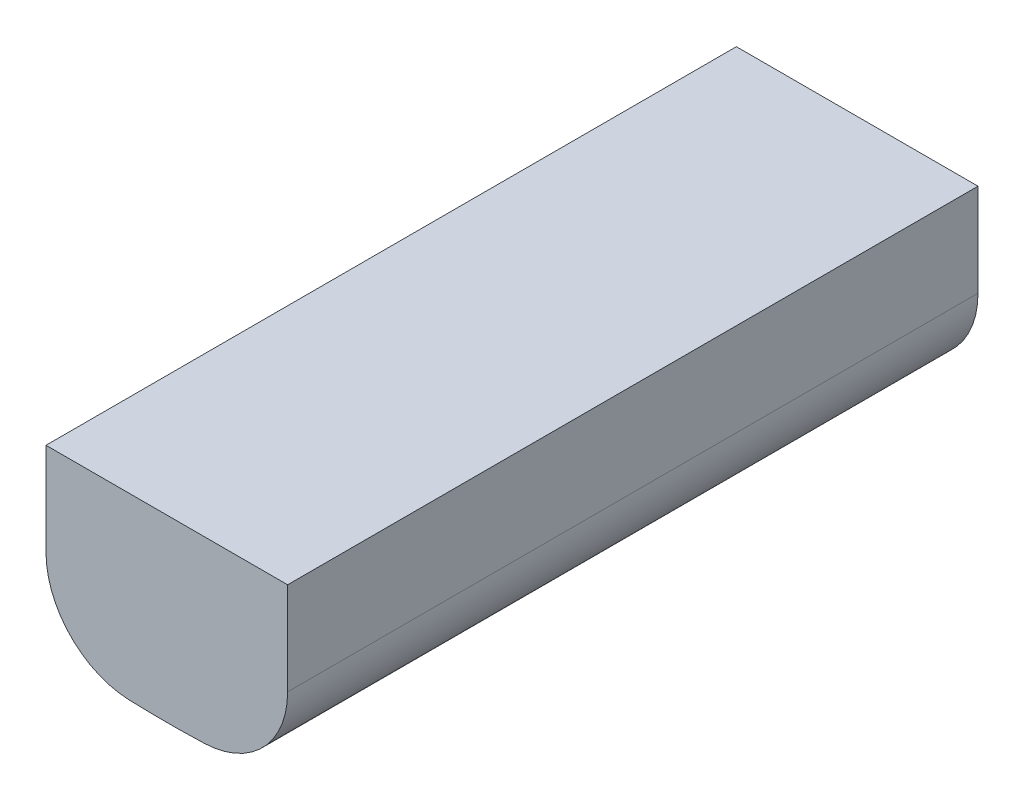
ISO-10303-21;
HEADER;
FILE_DESCRIPTION(('STEP AP214'),'2;1');
FILE_NAME('part.step','',(''),(''),'','','');
FILE_SCHEMA(('AUTOMOTIVE_DESIGN { 1 0 10303 214 1 1 1 1 }'));
ENDSEC;
DATA;
#1=APPLICATION_CONTEXT('core data for automotive mechanical design processes');
#2=APPLICATION_PROTOCOL_DEFINITION('international standard','automotive_design',2000,#1);
#3=PRODUCT_CONTEXT('',#1,'mechanical');
#4=PRODUCT('Part','Part','',(#3));
#5=PRODUCT_RELATED_PRODUCT_CATEGORY('part','',(#4));
#6=PRODUCT_DEFINITION_FORMATION('','',#4);
#7=PRODUCT_DEFINITION_CONTEXT('part definition',#1,'design');
#8=PRODUCT_DEFINITION('design','',#6,#7);
#9=PRODUCT_DEFINITION_SHAPE('','',#8);
#10=(LENGTH_UNIT() NAMED_UNIT(*) SI_UNIT(.MILLI.,.METRE.));
#11=(NAMED_UNIT(*) PLANE_ANGLE_UNIT() SI_UNIT($,.RADIAN.));
#12=(NAMED_UNIT(*) SI_UNIT($,.STERADIAN.) SOLID_ANGLE_UNIT());
#13=UNCERTAINTY_MEASURE_WITH_UNIT(LENGTH_MEASURE(1.E-05),#10,'distance_accuracy_value','');
#14=(GEOMETRIC_REPRESENTATION_CONTEXT(3) GLOBAL_UNCERTAINTY_ASSIGNED_CONTEXT((#13)) GLOBAL_UNIT_ASSIGNED_CONTEXT((#10,
#11,#12)) REPRESENTATION_CONTEXT('',''));
#15=CARTESIAN_POINT('',(0.,0.,0.));
#16=DIRECTION('',(0.,0.,1.));
#17=DIRECTION('',(1.,0.,0.));
#18=AXIS2_PLACEMENT_3D('',#15,#16,#17);
#19=CARTESIAN_POINT('',(0.05,-1.37409060836613,1.));
#20=DIRECTION('',(0.,0.,-1.));
#21=DIRECTION('',(-1.,0.,0.));
#22=AXIS2_PLACEMENT_3D('',#19,#20,#21);
#23=CYLINDRICAL_SURFACE('',#22,0.125);
#24=CARTESIAN_POINT('',(0.05,-1.37409060836613,0.));
#25=DIRECTION('',(0.,0.,1.));
#26=DIRECTION('',(-1.,0.,0.));
#27=AXIS2_PLACEMENT_3D('',#24,#25,#26);
#28=CIRCLE('',#27,0.125);
#29=CARTESIAN_POINT('',(0.0545454545454544,-1.49900793639941,0.));
#30=VERTEX_POINT('',#29);
#31=CARTESIAN_POINT('',(0.175,-1.37409060836613,0.));
#32=VERTEX_POINT('',#31);
#33=EDGE_CURVE('E116',#30,#32,#28,.T.);
#34=ORIENTED_EDGE('',*,*,#33,.T.);
#35=DIRECTION('',(0.,0.,-1.));
#36=VECTOR('',#35,1.);
#37=CARTESIAN_POINT('',(0.175,-1.37409060836613,1.));
#38=LINE('',#37,#36);
#39=CARTESIAN_POINT('',(0.175,-1.37409060836613,1.));
#40=VERTEX_POINT('',#39);
#41=EDGE_CURVE('E11',#40,#32,#38,.T.);
#42=ORIENTED_EDGE('',*,*,#41,.F.);
#43=CARTESIAN_POINT('',(0.05,-1.37409060836613,1.));
#44=DIRECTION('',(0.,0.,1.));
#45=DIRECTION('',(-1.,0.,0.));
#46=AXIS2_PLACEMENT_3D('',#43,#44,#45);
#47=CIRCLE('',#46,0.125);
#48=CARTESIAN_POINT('',(0.0545454545454544,-1.49900793639941,1.));
#49=VERTEX_POINT('',#48);
#50=EDGE_CURVE('E126',#49,#40,#47,.T.);
#51=ORIENTED_EDGE('',*,*,#50,.F.);
#52=DIRECTION('',(0.,0.,-1.));
#53=VECTOR('',#52,1.);
#54=CARTESIAN_POINT('',(0.0545454545454544,-1.49900793639941,1.));
#55=LINE('',#54,#53);
#56=EDGE_CURVE('E112',#49,#30,#55,.T.);
#57=ORIENTED_EDGE('',*,*,#56,.T.);
#58=EDGE_LOOP('',(#34,#42,#51,#57));
#59=FACE_BOUND('',#58,.T.);
#60=ADVANCED_FACE('F32',(#59),#23,.T.);
#61=CARTESIAN_POINT('',(0.175,-1.23975669154396,1.));
#62=DIRECTION('',(-1.,0.,0.));
#63=DIRECTION('',(0.,-1.,0.));
#64=AXIS2_PLACEMENT_3D('',#61,#62,#63);
#65=PLANE('',#64);
#66=DIRECTION('',(0.,1.,0.));
#67=VECTOR('',#66,1.);
#68=CARTESIAN_POINT('',(0.175,-1.23975669154396,0.));
#69=LINE('',#68,#67);
#70=CARTESIAN_POINT('',(0.175,-1.23975669154396,0.));
#71=VERTEX_POINT('',#70);
#72=EDGE_CURVE('E119',#32,#71,#69,.T.);
#73=ORIENTED_EDGE('',*,*,#72,.T.);
#74=DIRECTION('',(0.,0.,-1.));
#75=VECTOR('',#74,1.);
#76=CARTESIAN_POINT('',(0.175,-1.23975669154396,1.));
#77=LINE('',#76,#75);
#78=CARTESIAN_POINT('',(0.175,-1.23975669154396,1.));
#79=VERTEX_POINT('',#78);
#80=EDGE_CURVE('E40',#79,#71,#77,.T.);
#81=ORIENTED_EDGE('',*,*,#80,.F.);
#82=DIRECTION('',(0.,1.,0.));
#83=VECTOR('',#82,1.);
#84=CARTESIAN_POINT('',(0.175,-1.23975669154396,1.));
#85=LINE('',#84,#83);
#86=EDGE_CURVE('E85',#40,#79,#85,.T.);
#87=ORIENTED_EDGE('',*,*,#86,.F.);
#88=ORIENTED_EDGE('',*,*,#41,.T.);
#89=EDGE_LOOP('',(#73,#81,#87,#88));
#90=FACE_BOUND('',#89,.T.);
#91=ADVANCED_FACE('F150',(#90),#65,.F.);
#92=CARTESIAN_POINT('',(-0.175,-1.23975669154396,1.));
#93=DIRECTION('',(0.,-1.,0.));
#94=DIRECTION('',(1.,0.,0.));
#95=AXIS2_PLACEMENT_3D('',#92,#93,#94);
#96=PLANE('',#95);
#97=DIRECTION('',(-1.,0.,0.));
#98=VECTOR('',#97,1.);
#99=CARTESIAN_POINT('',(-0.175,-1.23975669154396,0.));
#100=LINE('',#99,#98);
#101=CARTESIAN_POINT('',(-0.175,-1.23975669154396,0.));
#102=VERTEX_POINT('',#101);
#103=EDGE_CURVE('E121',#71,#102,#100,.T.);
#104=ORIENTED_EDGE('',*,*,#103,.T.);
#105=DIRECTION('',(0.,0.,-1.));
#106=VECTOR('',#105,1.);
#107=CARTESIAN_POINT('',(-0.175,-1.23975669154396,1.));
#108=LINE('',#107,#106);
#109=CARTESIAN_POINT('',(-0.175,-1.23975669154396,1.));
#110=VERTEX_POINT('',#109);
#111=EDGE_CURVE('E107',#110,#102,#108,.T.);
#112=ORIENTED_EDGE('',*,*,#111,.F.);
#113=DIRECTION('',(-1.,0.,0.));
#114=VECTOR('',#113,1.);
#115=CARTESIAN_POINT('',(-0.175,-1.23975669154396,1.));
#116=LINE('',#115,#114);
#117=EDGE_CURVE('E98',#79,#110,#116,.T.);
#118=ORIENTED_EDGE('',*,*,#117,.F.);
#119=ORIENTED_EDGE('',*,*,#80,.T.);
#120=EDGE_LOOP('',(#104,#112,#118,#119));
#121=FACE_BOUND('',#120,.T.);
#122=ADVANCED_FACE('F132',(#121),#96,.F.);
#123=CARTESIAN_POINT('',(-0.175,-1.23975669154396,1.));
#124=DIRECTION('',(1.,0.,0.));
#125=DIRECTION('',(0.,1.,0.));
#126=AXIS2_PLACEMENT_3D('',#123,#124,#125);
#127=PLANE('',#126);
#128=DIRECTION('',(0.,-1.,0.));
#129=VECTOR('',#128,1.);
#130=CARTESIAN_POINT('',(-0.175,-1.23975669154396,0.));
#131=LINE('',#130,#129);
#132=CARTESIAN_POINT('',(-0.175,-1.37409060836613,0.));
#133=VERTEX_POINT('',#132);
#134=EDGE_CURVE('E106',#102,#133,#131,.T.);
#135=ORIENTED_EDGE('',*,*,#134,.T.);
#136=DIRECTION('',(0.,0.,-1.));
#137=VECTOR('',#136,1.);
#138=CARTESIAN_POINT('',(-0.175,-1.37409060836613,1.));
#139=LINE('',#138,#137);
#140=CARTESIAN_POINT('',(-0.175,-1.37409060836613,1.));
#141=VERTEX_POINT('',#140);
#142=EDGE_CURVE('E103',#141,#133,#139,.T.);
#143=ORIENTED_EDGE('',*,*,#142,.F.);
#144=DIRECTION('',(0.,-1.,0.));
#145=VECTOR('',#144,1.);
#146=CARTESIAN_POINT('',(-0.175,-1.23975669154396,1.));
#147=LINE('',#146,#145);
#148=EDGE_CURVE('E92',#110,#141,#147,.T.);
#149=ORIENTED_EDGE('',*,*,#148,.F.);
#150=ORIENTED_EDGE('',*,*,#111,.T.);
#151=EDGE_LOOP('',(#135,#143,#149,#150));
#152=FACE_BOUND('',#151,.T.);
#153=ADVANCED_FACE('F104',(#152),#127,.F.);
#154=CARTESIAN_POINT('',(-0.05,-1.37409060836613,1.));
#155=DIRECTION('',(0.,0.,-1.));
#156=DIRECTION('',(-1.,0.,0.));
#157=AXIS2_PLACEMENT_3D('',#154,#155,#156);
#158=CYLINDRICAL_SURFACE('',#157,0.125);
#159=CARTESIAN_POINT('',(-0.05,-1.37409060836613,0.));
#160=DIRECTION('',(0.,0.,1.));
#161=DIRECTION('',(1.,0.,0.));
#162=AXIS2_PLACEMENT_3D('',#159,#160,#161);
#163=CIRCLE('',#162,0.125);
#164=CARTESIAN_POINT('',(-0.0545454545454546,-1.49900793639941,0.));
#165=VERTEX_POINT('',#164);
#166=EDGE_CURVE('E71',#133,#165,#163,.T.);
#167=ORIENTED_EDGE('',*,*,#166,.T.);
#168=DIRECTION('',(0.,0.,-1.));
#169=VECTOR('',#168,1.);
#170=CARTESIAN_POINT('',(-0.0545454545454546,-1.49900793639941,1.));
#171=LINE('',#170,#169);
#172=CARTESIAN_POINT('',(-0.0545454545454546,-1.49900793639941,1.));
#173=VERTEX_POINT('',#172);
#174=EDGE_CURVE('E108',#173,#165,#171,.T.);
#175=ORIENTED_EDGE('',*,*,#174,.F.);
#176=CARTESIAN_POINT('',(-0.05,-1.37409060836613,1.));
#177=DIRECTION('',(0.,0.,1.));
#178=DIRECTION('',(1.,0.,0.));
#179=AXIS2_PLACEMENT_3D('',#176,#177,#178);
#180=CIRCLE('',#179,0.125);
#181=EDGE_CURVE('E96',#141,#173,#180,.T.);
#182=ORIENTED_EDGE('',*,*,#181,.F.);
#183=ORIENTED_EDGE('',*,*,#142,.T.);
#184=EDGE_LOOP('',(#167,#175,#182,#183));
#185=FACE_BOUND('',#184,.T.);
#186=ADVANCED_FACE('F110',(#185),#158,.T.);
#187=CARTESIAN_POINT('',(0.,0.,1.));
#188=DIRECTION('',(0.,0.,-1.));
#189=DIRECTION('',(-1.,0.,0.));
#190=AXIS2_PLACEMENT_3D('',#187,#188,#189);
#191=CYLINDRICAL_SURFACE('',#190,1.5);
#192=CARTESIAN_POINT('',(0.,0.,0.));
#193=DIRECTION('',(0.,0.,1.));
#194=DIRECTION('',(1.,0.,0.));
#195=AXIS2_PLACEMENT_3D('',#192,#193,#194);
#196=CIRCLE('',#195,1.5);
#197=EDGE_CURVE('E77',#165,#30,#196,.T.);
#198=ORIENTED_EDGE('',*,*,#197,.T.);
#199=ORIENTED_EDGE('',*,*,#56,.F.);
#200=CARTESIAN_POINT('',(0.,0.,1.));
#201=DIRECTION('',(0.,0.,1.));
#202=DIRECTION('',(1.,0.,0.));
#203=AXIS2_PLACEMENT_3D('',#200,#201,#202);
#204=CIRCLE('',#203,1.5);
#205=EDGE_CURVE('E48',#173,#49,#204,.T.);
#206=ORIENTED_EDGE('',*,*,#205,.F.);
#207=ORIENTED_EDGE('',*,*,#174,.T.);
#208=EDGE_LOOP('',(#198,#199,#206,#207));
#209=FACE_BOUND('',#208,.T.);
#210=ADVANCED_FACE('F139',(#209),#191,.T.);
#211=CARTESIAN_POINT('',(0.05,-1.37409060836613,1.));
#212=DIRECTION('',(0.,0.,-1.));
#213=DIRECTION('',(-1.,0.,0.));
#214=AXIS2_PLACEMENT_3D('',#211,#212,#213);
#215=PLANE('',#214);
#216=ORIENTED_EDGE('',*,*,#50,.T.);
#217=ORIENTED_EDGE('',*,*,#86,.T.);
#218=ORIENTED_EDGE('',*,*,#117,.T.);
#219=ORIENTED_EDGE('',*,*,#148,.T.);
#220=ORIENTED_EDGE('',*,*,#181,.T.);
#221=ORIENTED_EDGE('',*,*,#205,.T.);
#222=EDGE_LOOP('',(#216,#217,#218,#219,#220,#221));
#223=FACE_BOUND('',#222,.T.);
#224=ADVANCED_FACE('F94',(#223),#215,.F.);
#225=CARTESIAN_POINT('',(0.05,-1.37409060836613,0.));
#226=DIRECTION('',(0.,0.,-1.));
#227=DIRECTION('',(-1.,0.,0.));
#228=AXIS2_PLACEMENT_3D('',#225,#226,#227);
#229=PLANE('',#228);
#230=ORIENTED_EDGE('',*,*,#33,.F.);
#231=ORIENTED_EDGE('',*,*,#197,.F.);
#232=ORIENTED_EDGE('',*,*,#166,.F.);
#233=ORIENTED_EDGE('',*,*,#134,.F.);
#234=ORIENTED_EDGE('',*,*,#103,.F.);
#235=ORIENTED_EDGE('',*,*,#72,.F.);
#236=EDGE_LOOP('',(#230,#231,#232,#233,#234,#235));
#237=FACE_BOUND('',#236,.T.);
#238=ADVANCED_FACE('F135',(#237),#229,.T.);
#239=CLOSED_SHELL('',(#60,#91,#122,#153,#186,#210,#224,#238));
#240=MANIFOLD_SOLID_BREP('B2',#239);
#241=ADVANCED_BREP_SHAPE_REPRESENTATION('',(#18,#240),#14);
#242=SHAPE_DEFINITION_REPRESENTATION(#9,#241);
ENDSEC;
END-ISO-10303-21;
